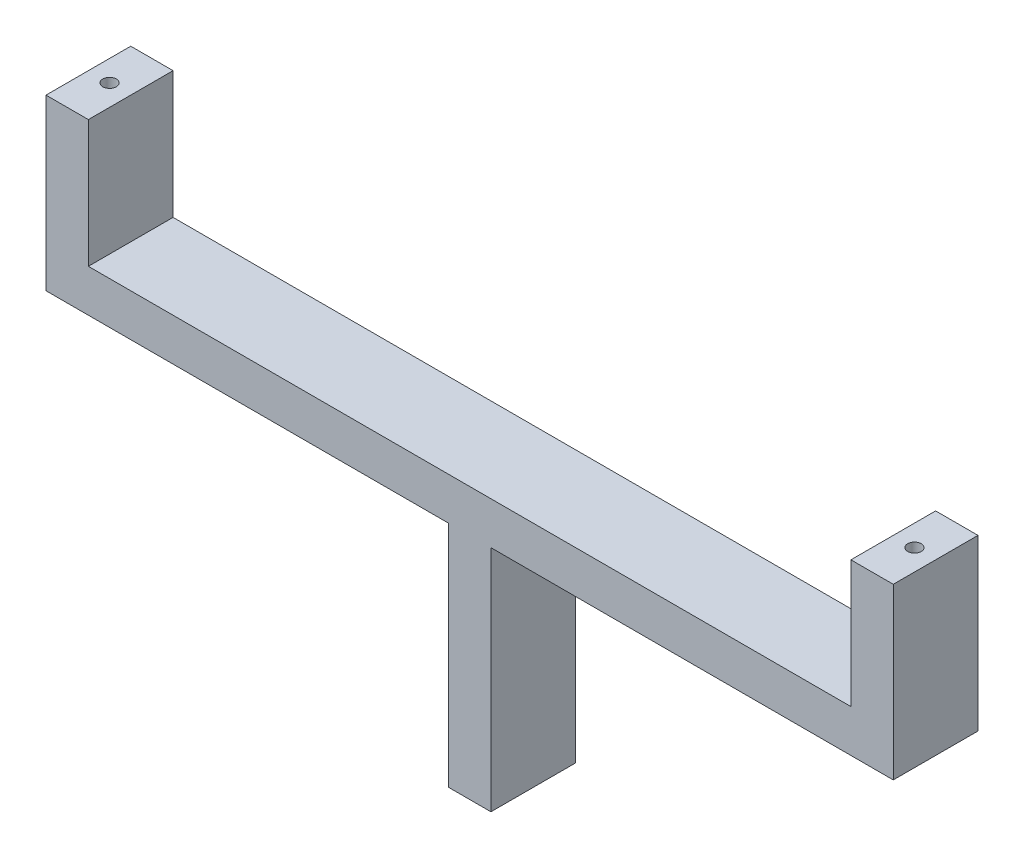
ISO-10303-21;
HEADER;
FILE_DESCRIPTION(('STEP AP214'),'2;1');
FILE_NAME('part.step','',(''),(''),'','','');
FILE_SCHEMA(('AUTOMOTIVE_DESIGN { 1 0 10303 214 1 1 1 1 }'));
ENDSEC;
DATA;
#1=APPLICATION_CONTEXT('core data for automotive mechanical design processes');
#2=APPLICATION_PROTOCOL_DEFINITION('international standard','automotive_design',2000,#1);
#3=PRODUCT_CONTEXT('',#1,'mechanical');
#4=PRODUCT('Part','Part','',(#3));
#5=PRODUCT_RELATED_PRODUCT_CATEGORY('part','',(#4));
#6=PRODUCT_DEFINITION_FORMATION('','',#4);
#7=PRODUCT_DEFINITION_CONTEXT('part definition',#1,'design');
#8=PRODUCT_DEFINITION('design','',#6,#7);
#9=PRODUCT_DEFINITION_SHAPE('','',#8);
#10=(LENGTH_UNIT() NAMED_UNIT(*) SI_UNIT(.MILLI.,.METRE.));
#11=(NAMED_UNIT(*) PLANE_ANGLE_UNIT() SI_UNIT($,.RADIAN.));
#12=(NAMED_UNIT(*) SI_UNIT($,.STERADIAN.) SOLID_ANGLE_UNIT());
#13=UNCERTAINTY_MEASURE_WITH_UNIT(LENGTH_MEASURE(1.E-05),#10,'distance_accuracy_value','');
#14=(GEOMETRIC_REPRESENTATION_CONTEXT(3) GLOBAL_UNCERTAINTY_ASSIGNED_CONTEXT((#13)) GLOBAL_UNIT_ASSIGNED_CONTEXT((#10,
#11,#12)) REPRESENTATION_CONTEXT('',''));
#15=CARTESIAN_POINT('',(0.,0.,0.));
#16=DIRECTION('',(0.,0.,1.));
#17=DIRECTION('',(1.,0.,0.));
#18=AXIS2_PLACEMENT_3D('',#15,#16,#17);
#19=CARTESIAN_POINT('',(0.,0.,0.));
#20=DIRECTION('',(0.,-1.,0.));
#21=DIRECTION('',(0.,0.,-1.));
#22=AXIS2_PLACEMENT_3D('',#19,#20,#21);
#23=PLANE('',#22);
#24=DIRECTION('',(0.,0.,1.));
#25=VECTOR('',#24,1.);
#26=CARTESIAN_POINT('',(2.5145920639535,0.,5.));
#27=LINE('',#26,#25);
#28=CARTESIAN_POINT('',(2.51459206395351,0.,-5.));
#29=VERTEX_POINT('',#28);
#30=CARTESIAN_POINT('',(2.51459206395351,0.,5.));
#31=VERTEX_POINT('',#30);
#32=EDGE_CURVE('E47',#29,#31,#27,.T.);
#33=ORIENTED_EDGE('',*,*,#32,.F.);
#34=DIRECTION('',(-1.,0.,0.));
#35=VECTOR('',#34,1.);
#36=CARTESIAN_POINT('',(-50.,0.,-5.));
#37=LINE('',#36,#35);
#38=CARTESIAN_POINT('',(50.,0.,-5.));
#39=VERTEX_POINT('',#38);
#40=EDGE_CURVE('E207',#39,#29,#37,.T.);
#41=ORIENTED_EDGE('',*,*,#40,.F.);
#42=DIRECTION('',(0.,0.,-1.));
#43=VECTOR('',#42,1.);
#44=CARTESIAN_POINT('',(50.,0.,5.));
#45=LINE('',#44,#43);
#46=CARTESIAN_POINT('',(50.,0.,5.));
#47=VERTEX_POINT('',#46);
#48=EDGE_CURVE('E197',#47,#39,#45,.T.);
#49=ORIENTED_EDGE('',*,*,#48,.F.);
#50=DIRECTION('',(1.,0.,0.));
#51=VECTOR('',#50,1.);
#52=CARTESIAN_POINT('',(-50.,0.,5.));
#53=LINE('',#52,#51);
#54=EDGE_CURVE('E52',#31,#47,#53,.T.);
#55=ORIENTED_EDGE('',*,*,#54,.F.);
#56=EDGE_LOOP('',(#33,#41,#49,#55));
#57=FACE_BOUND('',#56,.T.);
#58=ADVANCED_FACE('F32',(#57),#23,.T.);
#59=CARTESIAN_POINT('',(0.,5.,0.));
#60=DIRECTION('',(0.,-1.,0.));
#61=DIRECTION('',(0.,0.,-1.));
#62=AXIS2_PLACEMENT_3D('',#59,#60,#61);
#63=PLANE('',#62);
#64=DIRECTION('',(0.,0.,1.));
#65=VECTOR('',#64,1.);
#66=CARTESIAN_POINT('',(45.,5.,-5.));
#67=LINE('',#66,#65);
#68=CARTESIAN_POINT('',(45.,5.,-5.));
#69=VERTEX_POINT('',#68);
#70=CARTESIAN_POINT('',(45.,5.,5.));
#71=VERTEX_POINT('',#70);
#72=EDGE_CURVE('E154',#69,#71,#67,.T.);
#73=ORIENTED_EDGE('',*,*,#72,.F.);
#74=DIRECTION('',(-1.,0.,0.));
#75=VECTOR('',#74,1.);
#76=CARTESIAN_POINT('',(-50.,5.,-5.));
#77=LINE('',#76,#75);
#78=CARTESIAN_POINT('',(-45.,5.,-5.));
#79=VERTEX_POINT('',#78);
#80=EDGE_CURVE('E198',#69,#79,#77,.T.);
#81=ORIENTED_EDGE('',*,*,#80,.T.);
#82=DIRECTION('',(0.,0.,-1.));
#83=VECTOR('',#82,1.);
#84=CARTESIAN_POINT('',(-45.,5.,5.));
#85=LINE('',#84,#83);
#86=CARTESIAN_POINT('',(-45.,5.,5.));
#87=VERTEX_POINT('',#86);
#88=EDGE_CURVE('E178',#87,#79,#85,.T.);
#89=ORIENTED_EDGE('',*,*,#88,.F.);
#90=DIRECTION('',(1.,0.,0.));
#91=VECTOR('',#90,1.);
#92=CARTESIAN_POINT('',(-50.,5.,5.));
#93=LINE('',#92,#91);
#94=EDGE_CURVE('E200',#87,#71,#93,.T.);
#95=ORIENTED_EDGE('',*,*,#94,.T.);
#96=EDGE_LOOP('',(#73,#81,#89,#95));
#97=FACE_BOUND('',#96,.T.);
#98=ADVANCED_FACE('F261',(#97),#63,.F.);
#99=CARTESIAN_POINT('',(50.,5.,5.));
#100=DIRECTION('',(-1.,0.,0.));
#101=DIRECTION('',(0.,0.,1.));
#102=AXIS2_PLACEMENT_3D('',#99,#100,#101);
#103=PLANE('',#102);
#104=ORIENTED_EDGE('',*,*,#48,.T.);
#105=DIRECTION('',(0.,-1.,0.));
#106=VECTOR('',#105,1.);
#107=CARTESIAN_POINT('',(50.,5.,-5.));
#108=LINE('',#107,#106);
#109=CARTESIAN_POINT('',(50.,20.,-5.));
#110=VERTEX_POINT('',#109);
#111=EDGE_CURVE('E11',#110,#39,#108,.T.);
#112=ORIENTED_EDGE('',*,*,#111,.F.);
#113=DIRECTION('',(0.,0.,-1.));
#114=VECTOR('',#113,1.);
#115=CARTESIAN_POINT('',(50.,20.,-5.));
#116=LINE('',#115,#114);
#117=CARTESIAN_POINT('',(50.,20.,4.99999999999999));
#118=VERTEX_POINT('',#117);
#119=EDGE_CURVE('E160',#118,#110,#116,.T.);
#120=ORIENTED_EDGE('',*,*,#119,.F.);
#121=DIRECTION('',(0.,-1.,0.));
#122=VECTOR('',#121,1.);
#123=CARTESIAN_POINT('',(50.,5.,5.));
#124=LINE('',#123,#122);
#125=EDGE_CURVE('E203',#118,#47,#124,.T.);
#126=ORIENTED_EDGE('',*,*,#125,.T.);
#127=EDGE_LOOP('',(#104,#112,#120,#126));
#128=FACE_BOUND('',#127,.T.);
#129=ADVANCED_FACE('F34',(#128),#103,.F.);
#130=CARTESIAN_POINT('',(-50.,5.,-5.));
#131=DIRECTION('',(0.,0.,1.));
#132=DIRECTION('',(1.,0.,0.));
#133=AXIS2_PLACEMENT_3D('',#130,#131,#132);
#134=PLANE('',#133);
#135=ORIENTED_EDGE('',*,*,#40,.T.);
#136=DIRECTION('',(0.,1.,0.));
#137=VECTOR('',#136,1.);
#138=CARTESIAN_POINT('',(2.5145920639535,-27.,-5.));
#139=LINE('',#138,#137);
#140=CARTESIAN_POINT('',(2.5145920639535,-27.,-5.));
#141=VERTEX_POINT('',#140);
#142=EDGE_CURVE('E233',#141,#29,#139,.T.);
#143=ORIENTED_EDGE('',*,*,#142,.F.);
#144=DIRECTION('',(1.,0.,0.));
#145=VECTOR('',#144,1.);
#146=CARTESIAN_POINT('',(-2.51459206395351,-27.,-5.));
#147=LINE('',#146,#145);
#148=CARTESIAN_POINT('',(-2.51459206395351,-27.,-5.));
#149=VERTEX_POINT('',#148);
#150=EDGE_CURVE('E135',#149,#141,#147,.T.);
#151=ORIENTED_EDGE('',*,*,#150,.F.);
#152=DIRECTION('',(0.,1.,0.));
#153=VECTOR('',#152,1.);
#154=CARTESIAN_POINT('',(-2.51459206395351,-27.,-5.));
#155=LINE('',#154,#153);
#156=CARTESIAN_POINT('',(-2.51459206395351,0.,-5.));
#157=VERTEX_POINT('',#156);
#158=EDGE_CURVE('E147',#149,#157,#155,.T.);
#159=ORIENTED_EDGE('',*,*,#158,.T.);
#160=CARTESIAN_POINT('',(-50.,0.,-5.));
#161=VERTEX_POINT('',#160);
#162=EDGE_CURVE('E206',#157,#161,#37,.T.);
#163=ORIENTED_EDGE('',*,*,#162,.T.);
#164=DIRECTION('',(0.,-1.,0.));
#165=VECTOR('',#164,1.);
#166=CARTESIAN_POINT('',(-50.,5.,-5.));
#167=LINE('',#166,#165);
#168=CARTESIAN_POINT('',(-50.,20.,-5.));
#169=VERTEX_POINT('',#168);
#170=EDGE_CURVE('E40',#169,#161,#167,.T.);
#171=ORIENTED_EDGE('',*,*,#170,.F.);
#172=DIRECTION('',(-1.,0.,0.));
#173=VECTOR('',#172,1.);
#174=CARTESIAN_POINT('',(-50.,20.,-5.));
#175=LINE('',#174,#173);
#176=CARTESIAN_POINT('',(-45.,20.,-5.));
#177=VERTEX_POINT('',#176);
#178=EDGE_CURVE('E186',#177,#169,#175,.T.);
#179=ORIENTED_EDGE('',*,*,#178,.F.);
#180=DIRECTION('',(0.,-1.,0.));
#181=VECTOR('',#180,1.);
#182=CARTESIAN_POINT('',(-45.,20.,-5.));
#183=LINE('',#182,#181);
#184=EDGE_CURVE('E189',#177,#79,#183,.T.);
#185=ORIENTED_EDGE('',*,*,#184,.T.);
#186=ORIENTED_EDGE('',*,*,#80,.F.);
#187=DIRECTION('',(0.,-1.,0.));
#188=VECTOR('',#187,1.);
#189=CARTESIAN_POINT('',(45.,20.,-5.));
#190=LINE('',#189,#188);
#191=CARTESIAN_POINT('',(45.,20.,-5.));
#192=VERTEX_POINT('',#191);
#193=EDGE_CURVE('E175',#192,#69,#190,.T.);
#194=ORIENTED_EDGE('',*,*,#193,.F.);
#195=DIRECTION('',(-1.,0.,0.));
#196=VECTOR('',#195,1.);
#197=CARTESIAN_POINT('',(50.,20.,-5.));
#198=LINE('',#197,#196);
#199=EDGE_CURVE('E163',#110,#192,#198,.T.);
#200=ORIENTED_EDGE('',*,*,#199,.F.);
#201=ORIENTED_EDGE('',*,*,#111,.T.);
#202=EDGE_LOOP('',(#135,#143,#151,#159,#163,#171,#179,#185,#186,#194,#200,#201));
#203=FACE_BOUND('',#202,.T.);
#204=ADVANCED_FACE('F239',(#203),#134,.F.);
#205=CARTESIAN_POINT('',(-50.,5.,5.));
#206=DIRECTION('',(1.,0.,0.));
#207=DIRECTION('',(0.,0.,-1.));
#208=AXIS2_PLACEMENT_3D('',#205,#206,#207);
#209=PLANE('',#208);
#210=DIRECTION('',(0.,0.,1.));
#211=VECTOR('',#210,1.);
#212=CARTESIAN_POINT('',(-50.,0.,5.));
#213=LINE('',#212,#211);
#214=CARTESIAN_POINT('',(-50.,0.,5.));
#215=VERTEX_POINT('',#214);
#216=EDGE_CURVE('E209',#161,#215,#213,.T.);
#217=ORIENTED_EDGE('',*,*,#216,.T.);
#218=DIRECTION('',(0.,-1.,0.));
#219=VECTOR('',#218,1.);
#220=CARTESIAN_POINT('',(-50.,5.,5.));
#221=LINE('',#220,#219);
#222=CARTESIAN_POINT('',(-50.,20.,5.));
#223=VERTEX_POINT('',#222);
#224=EDGE_CURVE('E214',#223,#215,#221,.T.);
#225=ORIENTED_EDGE('',*,*,#224,.F.);
#226=DIRECTION('',(0.,0.,1.));
#227=VECTOR('',#226,1.);
#228=CARTESIAN_POINT('',(-50.,20.,5.));
#229=LINE('',#228,#227);
#230=EDGE_CURVE('E179',#169,#223,#229,.T.);
#231=ORIENTED_EDGE('',*,*,#230,.F.);
#232=ORIENTED_EDGE('',*,*,#170,.T.);
#233=EDGE_LOOP('',(#217,#225,#231,#232));
#234=FACE_BOUND('',#233,.T.);
#235=ADVANCED_FACE('F220',(#234),#209,.F.);
#236=CARTESIAN_POINT('',(-50.,5.,5.));
#237=DIRECTION('',(0.,0.,-1.));
#238=DIRECTION('',(-1.,0.,0.));
#239=AXIS2_PLACEMENT_3D('',#236,#237,#238);
#240=PLANE('',#239);
#241=CARTESIAN_POINT('',(-2.51459206395351,0.,5.));
#242=VERTEX_POINT('',#241);
#243=EDGE_CURVE('E201',#215,#242,#53,.T.);
#244=ORIENTED_EDGE('',*,*,#243,.T.);
#245=DIRECTION('',(0.,1.,0.));
#246=VECTOR('',#245,1.);
#247=CARTESIAN_POINT('',(-2.51459206395351,-27.,5.));
#248=LINE('',#247,#246);
#249=CARTESIAN_POINT('',(-2.51459206395351,-27.,5.));
#250=VERTEX_POINT('',#249);
#251=EDGE_CURVE('E126',#250,#242,#248,.T.);
#252=ORIENTED_EDGE('',*,*,#251,.F.);
#253=DIRECTION('',(-1.,0.,0.));
#254=VECTOR('',#253,1.);
#255=CARTESIAN_POINT('',(-2.51459206395351,-27.,5.));
#256=LINE('',#255,#254);
#257=CARTESIAN_POINT('',(2.5145920639535,-27.,5.));
#258=VERTEX_POINT('',#257);
#259=EDGE_CURVE('E119',#258,#250,#256,.T.);
#260=ORIENTED_EDGE('',*,*,#259,.F.);
#261=DIRECTION('',(0.,1.,0.));
#262=VECTOR('',#261,1.);
#263=CARTESIAN_POINT('',(2.5145920639535,-27.,5.));
#264=LINE('',#263,#262);
#265=EDGE_CURVE('E124',#258,#31,#264,.T.);
#266=ORIENTED_EDGE('',*,*,#265,.T.);
#267=ORIENTED_EDGE('',*,*,#54,.T.);
#268=ORIENTED_EDGE('',*,*,#125,.F.);
#269=DIRECTION('',(1.,0.,0.));
#270=VECTOR('',#269,1.);
#271=CARTESIAN_POINT('',(50.,20.,4.99999999999999));
#272=LINE('',#271,#270);
#273=CARTESIAN_POINT('',(45.,20.,4.99999999999999));
#274=VERTEX_POINT('',#273);
#275=EDGE_CURVE('E167',#274,#118,#272,.T.);
#276=ORIENTED_EDGE('',*,*,#275,.F.);
#277=DIRECTION('',(0.,-1.,0.));
#278=VECTOR('',#277,1.);
#279=CARTESIAN_POINT('',(45.,20.,4.99999999999999));
#280=LINE('',#279,#278);
#281=EDGE_CURVE('E170',#274,#71,#280,.T.);
#282=ORIENTED_EDGE('',*,*,#281,.T.);
#283=ORIENTED_EDGE('',*,*,#94,.F.);
#284=DIRECTION('',(0.,-1.,0.));
#285=VECTOR('',#284,1.);
#286=CARTESIAN_POINT('',(-45.,20.,5.));
#287=LINE('',#286,#285);
#288=CARTESIAN_POINT('',(-45.,20.,5.));
#289=VERTEX_POINT('',#288);
#290=EDGE_CURVE('E194',#289,#87,#287,.T.);
#291=ORIENTED_EDGE('',*,*,#290,.F.);
#292=DIRECTION('',(1.,0.,0.));
#293=VECTOR('',#292,1.);
#294=CARTESIAN_POINT('',(-50.,20.,5.));
#295=LINE('',#294,#293);
#296=EDGE_CURVE('E182',#223,#289,#295,.T.);
#297=ORIENTED_EDGE('',*,*,#296,.F.);
#298=ORIENTED_EDGE('',*,*,#224,.T.);
#299=EDGE_LOOP('',(#244,#252,#260,#266,#267,#268,#276,#282,#283,#291,#297,#298));
#300=FACE_BOUND('',#299,.T.);
#301=ADVANCED_FACE('F122',(#300),#240,.F.);
#302=DIRECTION('',(0.,0.,-1.));
#303=VECTOR('',#302,1.);
#304=CARTESIAN_POINT('',(-2.51459206395351,0.,5.));
#305=LINE('',#304,#303);
#306=EDGE_CURVE('E139',#242,#157,#305,.T.);
#307=ORIENTED_EDGE('',*,*,#306,.F.);
#308=ORIENTED_EDGE('',*,*,#243,.F.);
#309=ORIENTED_EDGE('',*,*,#216,.F.);
#310=ORIENTED_EDGE('',*,*,#162,.F.);
#311=EDGE_LOOP('',(#307,#308,#309,#310));
#312=FACE_BOUND('',#311,.T.);
#313=ADVANCED_FACE('F225',(#312),#23,.T.);
#314=CARTESIAN_POINT('',(-45.,20.,5.));
#315=DIRECTION('',(-1.,0.,0.));
#316=DIRECTION('',(0.,0.,1.));
#317=AXIS2_PLACEMENT_3D('',#314,#315,#316);
#318=PLANE('',#317);
#319=ORIENTED_EDGE('',*,*,#88,.T.);
#320=ORIENTED_EDGE('',*,*,#184,.F.);
#321=DIRECTION('',(0.,0.,-1.));
#322=VECTOR('',#321,1.);
#323=CARTESIAN_POINT('',(-45.,20.,5.));
#324=LINE('',#323,#322);
#325=EDGE_CURVE('E184',#289,#177,#324,.T.);
#326=ORIENTED_EDGE('',*,*,#325,.F.);
#327=ORIENTED_EDGE('',*,*,#290,.T.);
#328=EDGE_LOOP('',(#319,#320,#326,#327));
#329=FACE_BOUND('',#328,.T.);
#330=ADVANCED_FACE('F256',(#329),#318,.F.);
#331=CARTESIAN_POINT('',(0.,20.,0.));
#332=DIRECTION('',(0.,-1.,0.));
#333=DIRECTION('',(0.,0.,-1.));
#334=AXIS2_PLACEMENT_3D('',#331,#332,#333);
#335=PLANE('',#334);
#336=CARTESIAN_POINT('',(-47.5,20.,0.));
#337=DIRECTION('',(0.,1.,0.));
#338=DIRECTION('',(0.,0.,1.));
#339=AXIS2_PLACEMENT_3D('',#336,#337,#338);
#340=CIRCLE('',#339,0.800000000000003);
#341=CARTESIAN_POINT('',(-47.5,20.,0.800000000000003));
#342=VERTEX_POINT('',#341);
#343=EDGE_CURVE('E155',#342,#342,#340,.T.);
#344=ORIENTED_EDGE('',*,*,#343,.F.);
#345=EDGE_LOOP('',(#344));
#346=FACE_BOUND('',#345,.T.);
#347=ORIENTED_EDGE('',*,*,#230,.T.);
#348=ORIENTED_EDGE('',*,*,#296,.T.);
#349=ORIENTED_EDGE('',*,*,#325,.T.);
#350=ORIENTED_EDGE('',*,*,#178,.T.);
#351=EDGE_LOOP('',(#347,#348,#349,#350));
#352=FACE_BOUND('',#351,.T.);
#353=ADVANCED_FACE('F259',(#346,#352),#335,.F.);
#354=CARTESIAN_POINT('',(45.,20.,-5.));
#355=DIRECTION('',(1.,0.,0.));
#356=DIRECTION('',(0.,0.,-1.));
#357=AXIS2_PLACEMENT_3D('',#354,#355,#356);
#358=PLANE('',#357);
#359=ORIENTED_EDGE('',*,*,#72,.T.);
#360=ORIENTED_EDGE('',*,*,#281,.F.);
#361=DIRECTION('',(0.,0.,1.));
#362=VECTOR('',#361,1.);
#363=CARTESIAN_POINT('',(45.,20.,-5.));
#364=LINE('',#363,#362);
#365=EDGE_CURVE('E165',#192,#274,#364,.T.);
#366=ORIENTED_EDGE('',*,*,#365,.F.);
#367=ORIENTED_EDGE('',*,*,#193,.T.);
#368=EDGE_LOOP('',(#359,#360,#366,#367));
#369=FACE_BOUND('',#368,.T.);
#370=ADVANCED_FACE('F250',(#369),#358,.F.);
#371=CARTESIAN_POINT('',(0.,20.,0.));
#372=DIRECTION('',(0.,-1.,0.));
#373=DIRECTION('',(0.,0.,-1.));
#374=AXIS2_PLACEMENT_3D('',#371,#372,#373);
#375=PLANE('',#374);
#376=CARTESIAN_POINT('',(47.5,20.,0.));
#377=DIRECTION('',(0.,1.,0.));
#378=DIRECTION('',(0.,0.,1.));
#379=AXIS2_PLACEMENT_3D('',#376,#377,#378);
#380=CIRCLE('',#379,0.799999999999996);
#381=CARTESIAN_POINT('',(47.5,20.,0.799999999999996));
#382=VERTEX_POINT('',#381);
#383=EDGE_CURVE('E142',#382,#382,#380,.T.);
#384=ORIENTED_EDGE('',*,*,#383,.F.);
#385=EDGE_LOOP('',(#384));
#386=FACE_BOUND('',#385,.T.);
#387=ORIENTED_EDGE('',*,*,#119,.T.);
#388=ORIENTED_EDGE('',*,*,#199,.T.);
#389=ORIENTED_EDGE('',*,*,#365,.T.);
#390=ORIENTED_EDGE('',*,*,#275,.T.);
#391=EDGE_LOOP('',(#387,#388,#389,#390));
#392=FACE_BOUND('',#391,.T.);
#393=ADVANCED_FACE('F245',(#386,#392),#375,.F.);
#394=CARTESIAN_POINT('',(47.5,15.,0.));
#395=DIRECTION('',(0.,1.,0.));
#396=DIRECTION('',(0.,0.,1.));
#397=AXIS2_PLACEMENT_3D('',#394,#395,#396);
#398=CYLINDRICAL_SURFACE('',#397,0.799999999999996);
#399=CARTESIAN_POINT('',(47.5,15.,0.));
#400=DIRECTION('',(0.,1.,0.));
#401=DIRECTION('',(0.,0.,1.));
#402=AXIS2_PLACEMENT_3D('',#399,#400,#401);
#403=CIRCLE('',#402,0.799999999999996);
#404=CARTESIAN_POINT('',(47.5,15.,0.799999999999996));
#405=VERTEX_POINT('',#404);
#406=EDGE_CURVE('E145',#405,#405,#403,.T.);
#407=ORIENTED_EDGE('',*,*,#406,.F.);
#408=EDGE_LOOP('',(#407));
#409=FACE_BOUND('',#408,.T.);
#410=ORIENTED_EDGE('',*,*,#383,.T.);
#411=EDGE_LOOP('',(#410));
#412=FACE_BOUND('',#411,.T.);
#413=ADVANCED_FACE('F318',(#409,#412),#398,.F.);
#414=CARTESIAN_POINT('',(47.5,15.,0.));
#415=DIRECTION('',(0.,1.,0.));
#416=DIRECTION('',(0.,0.,1.));
#417=AXIS2_PLACEMENT_3D('',#414,#415,#416);
#418=PLANE('',#417);
#419=ORIENTED_EDGE('',*,*,#406,.T.);
#420=EDGE_LOOP('',(#419));
#421=FACE_BOUND('',#420,.T.);
#422=ADVANCED_FACE('F326',(#421),#418,.T.);
#423=CARTESIAN_POINT('',(-47.5,15.,0.));
#424=DIRECTION('',(0.,1.,0.));
#425=DIRECTION('',(0.,0.,1.));
#426=AXIS2_PLACEMENT_3D('',#423,#424,#425);
#427=CYLINDRICAL_SURFACE('',#426,0.800000000000003);
#428=CARTESIAN_POINT('',(-47.5,15.,0.));
#429=DIRECTION('',(0.,1.,0.));
#430=DIRECTION('',(0.,0.,1.));
#431=AXIS2_PLACEMENT_3D('',#428,#429,#430);
#432=CIRCLE('',#431,0.800000000000003);
#433=CARTESIAN_POINT('',(-47.5,15.,0.800000000000003));
#434=VERTEX_POINT('',#433);
#435=EDGE_CURVE('E151',#434,#434,#432,.T.);
#436=ORIENTED_EDGE('',*,*,#435,.F.);
#437=EDGE_LOOP('',(#436));
#438=FACE_BOUND('',#437,.T.);
#439=ORIENTED_EDGE('',*,*,#343,.T.);
#440=EDGE_LOOP('',(#439));
#441=FACE_BOUND('',#440,.T.);
#442=ADVANCED_FACE('F334',(#438,#441),#427,.F.);
#443=CARTESIAN_POINT('',(-47.5,15.,0.));
#444=DIRECTION('',(0.,1.,0.));
#445=DIRECTION('',(0.,0.,1.));
#446=AXIS2_PLACEMENT_3D('',#443,#444,#445);
#447=PLANE('',#446);
#448=ORIENTED_EDGE('',*,*,#435,.T.);
#449=EDGE_LOOP('',(#448));
#450=FACE_BOUND('',#449,.T.);
#451=ADVANCED_FACE('F342',(#450),#447,.T.);
#452=CARTESIAN_POINT('',(2.5145920639535,-27.,5.));
#453=DIRECTION('',(-1.,0.,0.));
#454=DIRECTION('',(0.,0.,1.));
#455=AXIS2_PLACEMENT_3D('',#452,#453,#454);
#456=PLANE('',#455);
#457=ORIENTED_EDGE('',*,*,#32,.T.);
#458=ORIENTED_EDGE('',*,*,#265,.F.);
#459=DIRECTION('',(0.,0.,1.));
#460=VECTOR('',#459,1.);
#461=CARTESIAN_POINT('',(2.5145920639535,-27.,5.));
#462=LINE('',#461,#460);
#463=EDGE_CURVE('E130',#141,#258,#462,.T.);
#464=ORIENTED_EDGE('',*,*,#463,.F.);
#465=ORIENTED_EDGE('',*,*,#142,.T.);
#466=EDGE_LOOP('',(#457,#458,#464,#465));
#467=FACE_BOUND('',#466,.T.);
#468=ADVANCED_FACE('F141',(#467),#456,.F.);
#469=CARTESIAN_POINT('',(-2.51459206395351,-27.,5.));
#470=DIRECTION('',(1.,0.,0.));
#471=DIRECTION('',(0.,0.,-1.));
#472=AXIS2_PLACEMENT_3D('',#469,#470,#471);
#473=PLANE('',#472);
#474=ORIENTED_EDGE('',*,*,#306,.T.);
#475=ORIENTED_EDGE('',*,*,#158,.F.);
#476=DIRECTION('',(0.,0.,-1.));
#477=VECTOR('',#476,1.);
#478=CARTESIAN_POINT('',(-2.51459206395351,-27.,5.));
#479=LINE('',#478,#477);
#480=EDGE_CURVE('E129',#250,#149,#479,.T.);
#481=ORIENTED_EDGE('',*,*,#480,.F.);
#482=ORIENTED_EDGE('',*,*,#251,.T.);
#483=EDGE_LOOP('',(#474,#475,#481,#482));
#484=FACE_BOUND('',#483,.T.);
#485=ADVANCED_FACE('F229',(#484),#473,.F.);
#486=CARTESIAN_POINT('',(0.,-27.,0.));
#487=DIRECTION('',(0.,-1.,0.));
#488=DIRECTION('',(0.,0.,-1.));
#489=AXIS2_PLACEMENT_3D('',#486,#487,#488);
#490=PLANE('',#489);
#491=CARTESIAN_POINT('',(0.,-27.,0.));
#492=DIRECTION('',(0.,-1.,0.));
#493=DIRECTION('',(0.,0.,-1.));
#494=AXIS2_PLACEMENT_3D('',#491,#492,#493);
#495=CIRCLE('',#494,0.8);
#496=CARTESIAN_POINT('',(0.,-27.,-0.8));
#497=VERTEX_POINT('',#496);
#498=EDGE_CURVE('E460',#497,#497,#495,.T.);
#499=ORIENTED_EDGE('',*,*,#498,.F.);
#500=EDGE_LOOP('',(#499));
#501=FACE_BOUND('',#500,.T.);
#502=ORIENTED_EDGE('',*,*,#463,.T.);
#503=ORIENTED_EDGE('',*,*,#259,.T.);
#504=ORIENTED_EDGE('',*,*,#480,.T.);
#505=ORIENTED_EDGE('',*,*,#150,.T.);
#506=EDGE_LOOP('',(#502,#503,#504,#505));
#507=FACE_BOUND('',#506,.T.);
#508=ADVANCED_FACE('F133',(#501,#507),#490,.T.);
#509=CARTESIAN_POINT('',(0.,-17.,0.));
#510=DIRECTION('',(0.,-1.,0.));
#511=DIRECTION('',(0.,0.,-1.));
#512=AXIS2_PLACEMENT_3D('',#509,#510,#511);
#513=CYLINDRICAL_SURFACE('',#512,0.8);
#514=CARTESIAN_POINT('',(0.,-17.,0.));
#515=DIRECTION('',(0.,-1.,0.));
#516=DIRECTION('',(0.,0.,-1.));
#517=AXIS2_PLACEMENT_3D('',#514,#515,#516);
#518=CIRCLE('',#517,0.8);
#519=CARTESIAN_POINT('',(0.,-17.,-0.8));
#520=VERTEX_POINT('',#519);
#521=EDGE_CURVE('E237',#520,#520,#518,.T.);
#522=ORIENTED_EDGE('',*,*,#521,.F.);
#523=EDGE_LOOP('',(#522));
#524=FACE_BOUND('',#523,.T.);
#525=ORIENTED_EDGE('',*,*,#498,.T.);
#526=EDGE_LOOP('',(#525));
#527=FACE_BOUND('',#526,.T.);
#528=ADVANCED_FACE('F368',(#524,#527),#513,.F.);
#529=CARTESIAN_POINT('',(0.,-17.,0.));
#530=DIRECTION('',(0.,-1.,0.));
#531=DIRECTION('',(0.,0.,-1.));
#532=AXIS2_PLACEMENT_3D('',#529,#530,#531);
#533=PLANE('',#532);
#534=ORIENTED_EDGE('',*,*,#521,.T.);
#535=EDGE_LOOP('',(#534));
#536=FACE_BOUND('',#535,.T.);
#537=ADVANCED_FACE('F376',(#536),#533,.T.);
#538=CLOSED_SHELL('',(#58,#98,#129,#204,#235,#301,#313,#330,#353,#370,#393,#413,#422,#442,#451,
#468,#485,#508,#528,#537));
#539=MANIFOLD_SOLID_BREP('B2',#538);
#540=ADVANCED_BREP_SHAPE_REPRESENTATION('',(#18,#539),#14);
#541=SHAPE_DEFINITION_REPRESENTATION(#9,#540);
ENDSEC;
END-ISO-10303-21;
